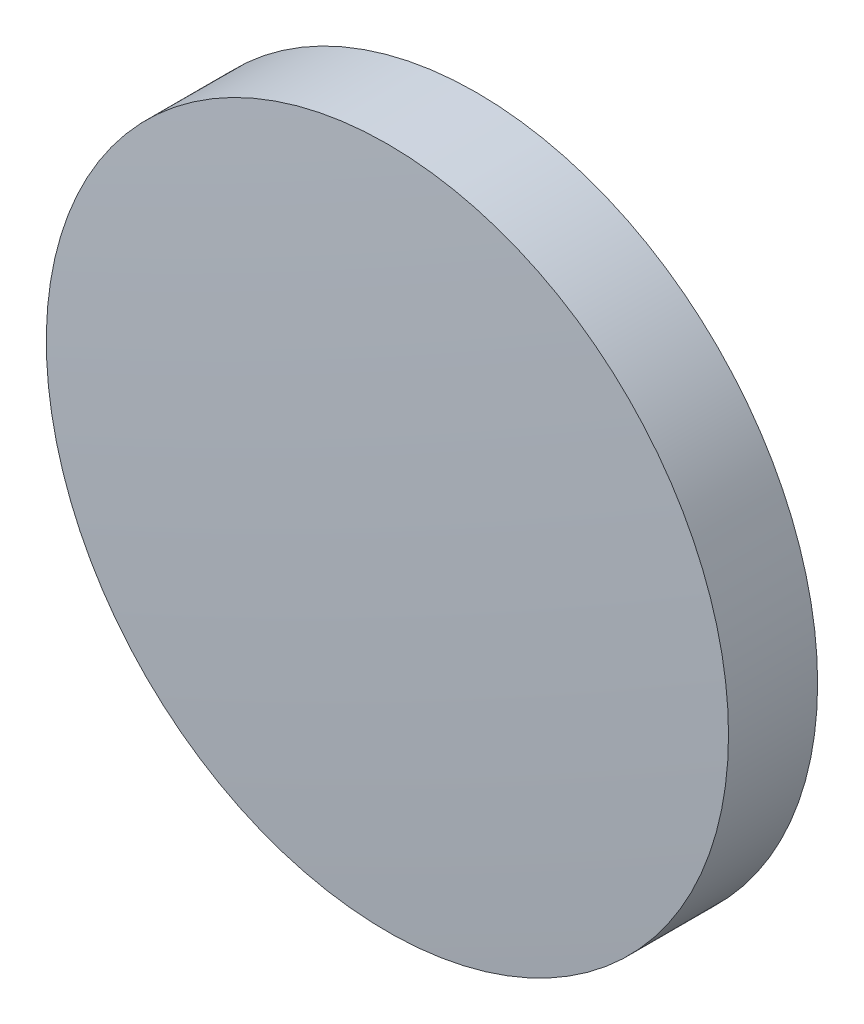
ISO-10303-21;
HEADER;
FILE_DESCRIPTION(('STEP AP214'),'2;1');
FILE_NAME('part.step','',(''),(''),'','','');
FILE_SCHEMA(('AUTOMOTIVE_DESIGN { 1 0 10303 214 1 1 1 1 }'));
ENDSEC;
DATA;
#1=APPLICATION_CONTEXT('core data for automotive mechanical design processes');
#2=APPLICATION_PROTOCOL_DEFINITION('international standard','automotive_design',2000,#1);
#3=PRODUCT_CONTEXT('',#1,'mechanical');
#4=PRODUCT('Part','Part','',(#3));
#5=PRODUCT_RELATED_PRODUCT_CATEGORY('part','',(#4));
#6=PRODUCT_DEFINITION_FORMATION('','',#4);
#7=PRODUCT_DEFINITION_CONTEXT('part definition',#1,'design');
#8=PRODUCT_DEFINITION('design','',#6,#7);
#9=PRODUCT_DEFINITION_SHAPE('','',#8);
#10=(LENGTH_UNIT() NAMED_UNIT(*) SI_UNIT(.MILLI.,.METRE.));
#11=(NAMED_UNIT(*) PLANE_ANGLE_UNIT() SI_UNIT($,.RADIAN.));
#12=(NAMED_UNIT(*) SI_UNIT($,.STERADIAN.) SOLID_ANGLE_UNIT());
#13=UNCERTAINTY_MEASURE_WITH_UNIT(LENGTH_MEASURE(1.E-05),#10,'distance_accuracy_value','');
#14=(GEOMETRIC_REPRESENTATION_CONTEXT(3) GLOBAL_UNCERTAINTY_ASSIGNED_CONTEXT((#13)) GLOBAL_UNIT_ASSIGNED_CONTEXT((#10,
#11,#12)) REPRESENTATION_CONTEXT('',''));
#15=CARTESIAN_POINT('',(0.,0.,0.));
#16=DIRECTION('',(0.,0.,1.));
#17=DIRECTION('',(1.,0.,0.));
#18=AXIS2_PLACEMENT_3D('',#15,#16,#17);
#19=CARTESIAN_POINT('',(0.,0.,-248.180031026245));
#20=DIRECTION('',(0.,0.,1.));
#21=DIRECTION('',(0.,1.,0.));
#22=AXIS2_PLACEMENT_3D('',#19,#20,#21);
#23=SPHERICAL_SURFACE('',#22,250.);
#24=CARTESIAN_POINT('',(0.,0.,1.49718058907209));
#25=DIRECTION('',(0.,0.,1.));
#26=DIRECTION('',(1.,0.,0.));
#27=AXIS2_PLACEMENT_3D('',#24,#25,#26);
#28=CIRCLE('',#27,12.7);
#29=CARTESIAN_POINT('',(12.7,0.,1.49718058907209));
#30=VERTEX_POINT('',#29);
#31=EDGE_CURVE('E8',#30,#30,#28,.T.);
#32=ORIENTED_EDGE('',*,*,#31,.T.);
#33=EDGE_LOOP('',(#32));
#34=FACE_BOUND('',#33,.T.);
#35=ADVANCED_FACE('F12',(#34),#23,.T.);
#36=CARTESIAN_POINT('',(0.,0.,9.22507272859573));
#37=DIRECTION('',(0.,0.,1.));
#38=DIRECTION('',(1.,0.,0.));
#39=AXIS2_PLACEMENT_3D('',#36,#37,#38);
#40=CYLINDRICAL_SURFACE('',#39,12.7);
#41=ORIENTED_EDGE('',*,*,#31,.F.);
#42=EDGE_LOOP('',(#41));
#43=FACE_BOUND('',#42,.T.);
#44=CARTESIAN_POINT('',(0.,0.,-1.81996897375468));
#45=DIRECTION('',(0.,0.,1.));
#46=DIRECTION('',(1.,0.,0.));
#47=AXIS2_PLACEMENT_3D('',#44,#45,#46);
#48=CIRCLE('',#47,12.7);
#49=CARTESIAN_POINT('',(12.7,0.,-1.81996897375468));
#50=VERTEX_POINT('',#49);
#51=EDGE_CURVE('E18',#50,#50,#48,.T.);
#52=ORIENTED_EDGE('',*,*,#51,.T.);
#53=EDGE_LOOP('',(#52));
#54=FACE_BOUND('',#53,.T.);
#55=ADVANCED_FACE('F24',(#43,#54),#40,.T.);
#56=CARTESIAN_POINT('',(0.,0.,-127.520031026245));
#57=DIRECTION('',(0.,0.,1.));
#58=DIRECTION('',(0.,1.,0.));
#59=AXIS2_PLACEMENT_3D('',#56,#57,#58);
#60=SPHERICAL_SURFACE('',#59,126.34);
#61=ORIENTED_EDGE('',*,*,#51,.F.);
#62=EDGE_LOOP('',(#61));
#63=FACE_BOUND('',#62,.T.);
#64=ADVANCED_FACE('F26',(#63),#60,.F.);
#65=CLOSED_SHELL('',(#35,#55,#64));
#66=MANIFOLD_SOLID_BREP('B1',#65);
#67=ADVANCED_BREP_SHAPE_REPRESENTATION('',(#18,#66),#14);
#68=SHAPE_DEFINITION_REPRESENTATION(#9,#67);
ENDSEC;
END-ISO-10303-21;
